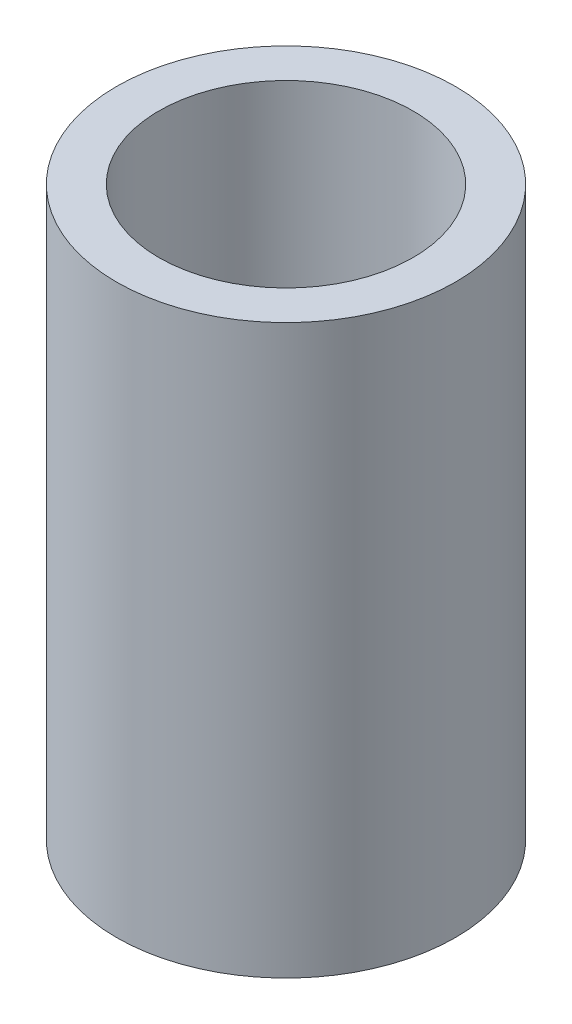
ISO-10303-21;
HEADER;
FILE_DESCRIPTION(('STEP AP214'),'2;1');
FILE_NAME('part.step','',(''),(''),'','','');
FILE_SCHEMA(('AUTOMOTIVE_DESIGN { 1 0 10303 214 1 1 1 1 }'));
ENDSEC;
DATA;
#1=APPLICATION_CONTEXT('core data for automotive mechanical design processes');
#2=APPLICATION_PROTOCOL_DEFINITION('international standard','automotive_design',2000,#1);
#3=PRODUCT_CONTEXT('',#1,'mechanical');
#4=PRODUCT('Part','Part','',(#3));
#5=PRODUCT_RELATED_PRODUCT_CATEGORY('part','',(#4));
#6=PRODUCT_DEFINITION_FORMATION('','',#4);
#7=PRODUCT_DEFINITION_CONTEXT('part definition',#1,'design');
#8=PRODUCT_DEFINITION('design','',#6,#7);
#9=PRODUCT_DEFINITION_SHAPE('','',#8);
#10=(LENGTH_UNIT() NAMED_UNIT(*) SI_UNIT(.MILLI.,.METRE.));
#11=(NAMED_UNIT(*) PLANE_ANGLE_UNIT() SI_UNIT($,.RADIAN.));
#12=(NAMED_UNIT(*) SI_UNIT($,.STERADIAN.) SOLID_ANGLE_UNIT());
#13=UNCERTAINTY_MEASURE_WITH_UNIT(LENGTH_MEASURE(1.E-05),#10,'distance_accuracy_value','');
#14=(GEOMETRIC_REPRESENTATION_CONTEXT(3) GLOBAL_UNCERTAINTY_ASSIGNED_CONTEXT((#13)) GLOBAL_UNIT_ASSIGNED_CONTEXT((#10,
#11,#12)) REPRESENTATION_CONTEXT('',''));
#15=CARTESIAN_POINT('',(0.,0.,0.));
#16=DIRECTION('',(0.,0.,1.));
#17=DIRECTION('',(1.,0.,0.));
#18=AXIS2_PLACEMENT_3D('',#15,#16,#17);
#19=CARTESIAN_POINT('',(0.,6.7,0.));
#20=DIRECTION('',(0.,1.,0.));
#21=DIRECTION('',(0.,0.,1.));
#22=AXIS2_PLACEMENT_3D('',#19,#20,#21);
#23=PLANE('',#22);
#24=CARTESIAN_POINT('',(0.,6.7,0.));
#25=DIRECTION('',(0.,1.,0.));
#26=DIRECTION('',(0.,0.,1.));
#27=AXIS2_PLACEMENT_3D('',#24,#25,#26);
#28=CIRCLE('',#27,2.);
#29=CARTESIAN_POINT('',(0.,6.7,2.));
#30=VERTEX_POINT('',#29);
#31=EDGE_CURVE('E10',#30,#30,#28,.T.);
#32=ORIENTED_EDGE('',*,*,#31,.T.);
#33=EDGE_LOOP('',(#32));
#34=FACE_BOUND('',#33,.T.);
#35=CARTESIAN_POINT('',(0.,6.7,0.));
#36=DIRECTION('',(0.,1.,0.));
#37=DIRECTION('',(0.,0.,1.));
#38=AXIS2_PLACEMENT_3D('',#35,#36,#37);
#39=CIRCLE('',#38,1.5);
#40=CARTESIAN_POINT('',(0.,6.7,1.5));
#41=VERTEX_POINT('',#40);
#42=EDGE_CURVE('E46',#41,#41,#39,.T.);
#43=ORIENTED_EDGE('',*,*,#42,.F.);
#44=EDGE_LOOP('',(#43));
#45=FACE_BOUND('',#44,.T.);
#46=ADVANCED_FACE('F35',(#34,#45),#23,.T.);
#47=CARTESIAN_POINT('',(0.,0.,0.));
#48=DIRECTION('',(0.,1.,0.));
#49=DIRECTION('',(0.,0.,1.));
#50=AXIS2_PLACEMENT_3D('',#47,#48,#49);
#51=PLANE('',#50);
#52=CARTESIAN_POINT('',(0.,0.,0.));
#53=DIRECTION('',(0.,1.,0.));
#54=DIRECTION('',(0.,0.,1.));
#55=AXIS2_PLACEMENT_3D('',#52,#53,#54);
#56=CIRCLE('',#55,2.);
#57=CARTESIAN_POINT('',(0.,0.,2.));
#58=VERTEX_POINT('',#57);
#59=EDGE_CURVE('E39',#58,#58,#56,.T.);
#60=ORIENTED_EDGE('',*,*,#59,.F.);
#61=EDGE_LOOP('',(#60));
#62=FACE_BOUND('',#61,.T.);
#63=CARTESIAN_POINT('',(0.,0.,0.));
#64=DIRECTION('',(0.,1.,0.));
#65=DIRECTION('',(0.,0.,1.));
#66=AXIS2_PLACEMENT_3D('',#63,#64,#65);
#67=CIRCLE('',#66,1.5);
#68=CARTESIAN_POINT('',(0.,0.,1.5));
#69=VERTEX_POINT('',#68);
#70=EDGE_CURVE('E48',#69,#69,#67,.T.);
#71=ORIENTED_EDGE('',*,*,#70,.T.);
#72=EDGE_LOOP('',(#71));
#73=FACE_BOUND('',#72,.T.);
#74=ADVANCED_FACE('F58',(#62,#73),#51,.F.);
#75=CARTESIAN_POINT('',(0.,6.7,0.));
#76=DIRECTION('',(0.,-1.,0.));
#77=DIRECTION('',(0.,0.,-1.));
#78=AXIS2_PLACEMENT_3D('',#75,#76,#77);
#79=CYLINDRICAL_SURFACE('',#78,2.);
#80=ORIENTED_EDGE('',*,*,#31,.F.);
#81=EDGE_LOOP('',(#80));
#82=FACE_BOUND('',#81,.T.);
#83=ORIENTED_EDGE('',*,*,#59,.T.);
#84=EDGE_LOOP('',(#83));
#85=FACE_BOUND('',#84,.T.);
#86=ADVANCED_FACE('F37',(#82,#85),#79,.T.);
#87=CARTESIAN_POINT('',(0.,6.7,0.));
#88=DIRECTION('',(0.,-1.,0.));
#89=DIRECTION('',(0.,0.,-1.));
#90=AXIS2_PLACEMENT_3D('',#87,#88,#89);
#91=CYLINDRICAL_SURFACE('',#90,1.5);
#92=ORIENTED_EDGE('',*,*,#42,.T.);
#93=EDGE_LOOP('',(#92));
#94=FACE_BOUND('',#93,.T.);
#95=ORIENTED_EDGE('',*,*,#70,.F.);
#96=EDGE_LOOP('',(#95));
#97=FACE_BOUND('',#96,.T.);
#98=ADVANCED_FACE('F54',(#94,#97),#91,.F.);
#99=CLOSED_SHELL('',(#46,#74,#86,#98));
#100=MANIFOLD_SOLID_BREP('B2',#99);
#101=ADVANCED_BREP_SHAPE_REPRESENTATION('',(#18,#100),#14);
#102=SHAPE_DEFINITION_REPRESENTATION(#9,#101);
ENDSEC;
END-ISO-10303-21;
